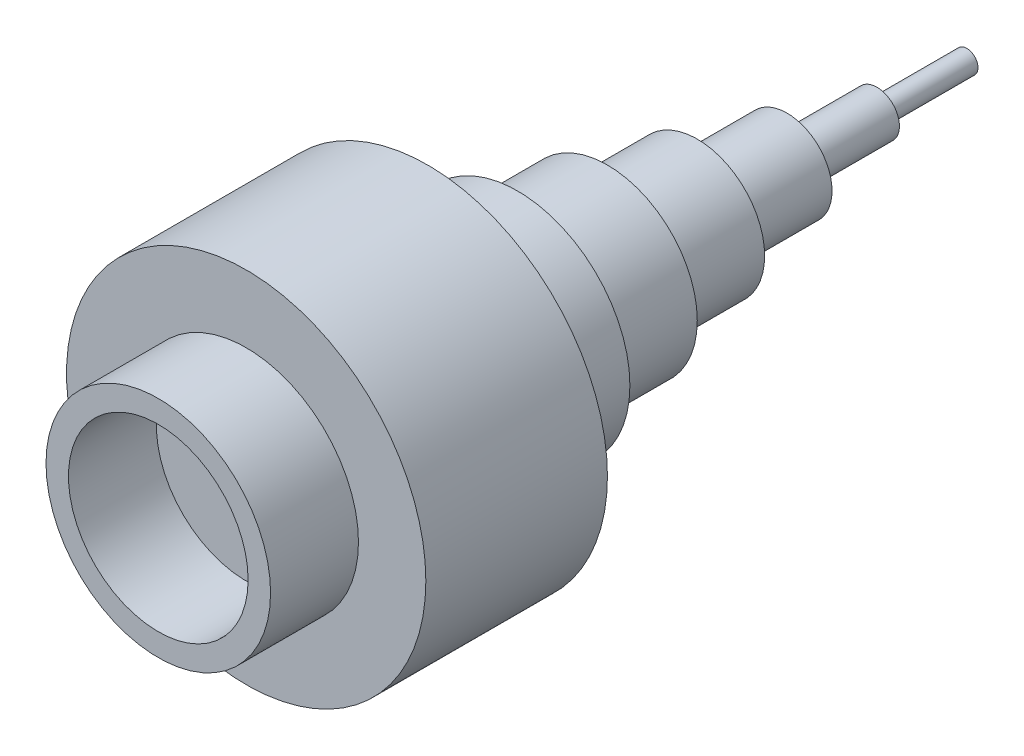
ISO-10303-21;
HEADER;
FILE_DESCRIPTION(('STEP AP214'),'2;1');
FILE_NAME('part.step','',(''),(''),'','','');
FILE_SCHEMA(('AUTOMOTIVE_DESIGN { 1 0 10303 214 1 1 1 1 }'));
ENDSEC;
DATA;
#1=APPLICATION_CONTEXT('core data for automotive mechanical design processes');
#2=APPLICATION_PROTOCOL_DEFINITION('international standard','automotive_design',2000,#1);
#3=PRODUCT_CONTEXT('',#1,'mechanical');
#4=PRODUCT('Part','Part','',(#3));
#5=PRODUCT_RELATED_PRODUCT_CATEGORY('part','',(#4));
#6=PRODUCT_DEFINITION_FORMATION('','',#4);
#7=PRODUCT_DEFINITION_CONTEXT('part definition',#1,'design');
#8=PRODUCT_DEFINITION('design','',#6,#7);
#9=PRODUCT_DEFINITION_SHAPE('','',#8);
#10=(LENGTH_UNIT() NAMED_UNIT(*) SI_UNIT(.MILLI.,.METRE.));
#11=(NAMED_UNIT(*) PLANE_ANGLE_UNIT() SI_UNIT($,.RADIAN.));
#12=(NAMED_UNIT(*) SI_UNIT($,.STERADIAN.) SOLID_ANGLE_UNIT());
#13=UNCERTAINTY_MEASURE_WITH_UNIT(LENGTH_MEASURE(1.E-05),#10,'distance_accuracy_value','');
#14=(GEOMETRIC_REPRESENTATION_CONTEXT(3) GLOBAL_UNCERTAINTY_ASSIGNED_CONTEXT((#13)) GLOBAL_UNIT_ASSIGNED_CONTEXT((#10,
#11,#12)) REPRESENTATION_CONTEXT('',''));
#15=CARTESIAN_POINT('',(0.,0.,0.));
#16=DIRECTION('',(0.,0.,1.));
#17=DIRECTION('',(1.,0.,0.));
#18=AXIS2_PLACEMENT_3D('',#15,#16,#17);
#19=CARTESIAN_POINT('',(0.,0.,-180.));
#20=DIRECTION('',(0.,0.,-1.));
#21=DIRECTION('',(-1.,0.,0.));
#22=AXIS2_PLACEMENT_3D('',#19,#20,#21);
#23=PLANE('',#22);
#24=CARTESIAN_POINT('',(0.,0.,-180.));
#25=DIRECTION('',(0.,0.,1.));
#26=DIRECTION('',(1.,0.,0.));
#27=AXIS2_PLACEMENT_3D('',#24,#25,#26);
#28=CIRCLE('',#27,2.5);
#29=CARTESIAN_POINT('',(2.5,0.,-180.));
#30=VERTEX_POINT('',#29);
#31=EDGE_CURVE('E10',#30,#30,#28,.T.);
#32=ORIENTED_EDGE('',*,*,#31,.F.);
#33=EDGE_LOOP('',(#32));
#34=FACE_BOUND('',#33,.T.);
#35=ADVANCED_FACE('F31',(#34),#23,.T.);
#36=CARTESIAN_POINT('',(0.,0.,0.));
#37=DIRECTION('',(0.,0.,1.));
#38=DIRECTION('',(1.,0.,0.));
#39=AXIS2_PLACEMENT_3D('',#36,#37,#38);
#40=CYLINDRICAL_SURFACE('',#39,2.5);
#41=ORIENTED_EDGE('',*,*,#31,.T.);
#42=EDGE_LOOP('',(#41));
#43=FACE_BOUND('',#42,.T.);
#44=CARTESIAN_POINT('',(0.,0.,-160.));
#45=DIRECTION('',(0.,0.,1.));
#46=DIRECTION('',(1.,0.,0.));
#47=AXIS2_PLACEMENT_3D('',#44,#45,#46);
#48=CIRCLE('',#47,2.5);
#49=CARTESIAN_POINT('',(2.5,0.,-160.));
#50=VERTEX_POINT('',#49);
#51=EDGE_CURVE('E37',#50,#50,#48,.T.);
#52=ORIENTED_EDGE('',*,*,#51,.F.);
#53=EDGE_LOOP('',(#52));
#54=FACE_BOUND('',#53,.T.);
#55=ADVANCED_FACE('F109',(#43,#54),#40,.T.);
#56=CARTESIAN_POINT('',(2.5,0.,-160.));
#57=DIRECTION('',(0.,0.,-1.));
#58=DIRECTION('',(-1.,0.,0.));
#59=AXIS2_PLACEMENT_3D('',#56,#57,#58);
#60=PLANE('',#59);
#61=ORIENTED_EDGE('',*,*,#51,.T.);
#62=EDGE_LOOP('',(#61));
#63=FACE_BOUND('',#62,.T.);
#64=CARTESIAN_POINT('',(0.,0.,-160.));
#65=DIRECTION('',(0.,0.,1.));
#66=DIRECTION('',(1.,0.,0.));
#67=AXIS2_PLACEMENT_3D('',#64,#65,#66);
#68=CIRCLE('',#67,5.);
#69=CARTESIAN_POINT('',(5.,0.,-160.));
#70=VERTEX_POINT('',#69);
#71=EDGE_CURVE('E41',#70,#70,#68,.T.);
#72=ORIENTED_EDGE('',*,*,#71,.F.);
#73=EDGE_LOOP('',(#72));
#74=FACE_BOUND('',#73,.T.);
#75=ADVANCED_FACE('F114',(#63,#74),#60,.T.);
#76=CARTESIAN_POINT('',(0.,0.,0.));
#77=DIRECTION('',(0.,0.,1.));
#78=DIRECTION('',(1.,0.,0.));
#79=AXIS2_PLACEMENT_3D('',#76,#77,#78);
#80=CYLINDRICAL_SURFACE('',#79,5.);
#81=ORIENTED_EDGE('',*,*,#71,.T.);
#82=EDGE_LOOP('',(#81));
#83=FACE_BOUND('',#82,.T.);
#84=CARTESIAN_POINT('',(0.,0.,-140.));
#85=DIRECTION('',(0.,0.,1.));
#86=DIRECTION('',(1.,0.,0.));
#87=AXIS2_PLACEMENT_3D('',#84,#85,#86);
#88=CIRCLE('',#87,5.);
#89=CARTESIAN_POINT('',(5.,0.,-140.));
#90=VERTEX_POINT('',#89);
#91=EDGE_CURVE('E45',#90,#90,#88,.T.);
#92=ORIENTED_EDGE('',*,*,#91,.F.);
#93=EDGE_LOOP('',(#92));
#94=FACE_BOUND('',#93,.T.);
#95=ADVANCED_FACE('F118',(#83,#94),#80,.T.);
#96=CARTESIAN_POINT('',(5.,0.,-140.));
#97=DIRECTION('',(0.,0.,-1.));
#98=DIRECTION('',(-1.,0.,0.));
#99=AXIS2_PLACEMENT_3D('',#96,#97,#98);
#100=PLANE('',#99);
#101=ORIENTED_EDGE('',*,*,#91,.T.);
#102=EDGE_LOOP('',(#101));
#103=FACE_BOUND('',#102,.T.);
#104=CARTESIAN_POINT('',(0.,0.,-140.));
#105=DIRECTION('',(0.,0.,1.));
#106=DIRECTION('',(1.,0.,0.));
#107=AXIS2_PLACEMENT_3D('',#104,#105,#106);
#108=CIRCLE('',#107,10.);
#109=CARTESIAN_POINT('',(10.,0.,-140.));
#110=VERTEX_POINT('',#109);
#111=EDGE_CURVE('E50',#110,#110,#108,.T.);
#112=ORIENTED_EDGE('',*,*,#111,.F.);
#113=EDGE_LOOP('',(#112));
#114=FACE_BOUND('',#113,.T.);
#115=ADVANCED_FACE('F124',(#103,#114),#100,.T.);
#116=CARTESIAN_POINT('',(0.,0.,0.));
#117=DIRECTION('',(0.,0.,1.));
#118=DIRECTION('',(1.,0.,0.));
#119=AXIS2_PLACEMENT_3D('',#116,#117,#118);
#120=CYLINDRICAL_SURFACE('',#119,10.);
#121=ORIENTED_EDGE('',*,*,#111,.T.);
#122=EDGE_LOOP('',(#121));
#123=FACE_BOUND('',#122,.T.);
#124=CARTESIAN_POINT('',(0.,0.,-120.));
#125=DIRECTION('',(0.,0.,1.));
#126=DIRECTION('',(1.,0.,0.));
#127=AXIS2_PLACEMENT_3D('',#124,#125,#126);
#128=CIRCLE('',#127,10.);
#129=CARTESIAN_POINT('',(10.,0.,-120.));
#130=VERTEX_POINT('',#129);
#131=EDGE_CURVE('E53',#130,#130,#128,.T.);
#132=ORIENTED_EDGE('',*,*,#131,.F.);
#133=EDGE_LOOP('',(#132));
#134=FACE_BOUND('',#133,.T.);
#135=ADVANCED_FACE('F128',(#123,#134),#120,.T.);
#136=CARTESIAN_POINT('',(10.,0.,-120.));
#137=DIRECTION('',(0.,0.,-1.));
#138=DIRECTION('',(-1.,0.,0.));
#139=AXIS2_PLACEMENT_3D('',#136,#137,#138);
#140=PLANE('',#139);
#141=ORIENTED_EDGE('',*,*,#131,.T.);
#142=EDGE_LOOP('',(#141));
#143=FACE_BOUND('',#142,.T.);
#144=CARTESIAN_POINT('',(0.,0.,-120.));
#145=DIRECTION('',(0.,0.,1.));
#146=DIRECTION('',(1.,0.,0.));
#147=AXIS2_PLACEMENT_3D('',#144,#145,#146);
#148=CIRCLE('',#147,15.);
#149=CARTESIAN_POINT('',(15.,0.,-120.));
#150=VERTEX_POINT('',#149);
#151=EDGE_CURVE('E56',#150,#150,#148,.T.);
#152=ORIENTED_EDGE('',*,*,#151,.F.);
#153=EDGE_LOOP('',(#152));
#154=FACE_BOUND('',#153,.T.);
#155=ADVANCED_FACE('F132',(#143,#154),#140,.T.);
#156=CARTESIAN_POINT('',(0.,0.,0.));
#157=DIRECTION('',(0.,0.,1.));
#158=DIRECTION('',(1.,0.,0.));
#159=AXIS2_PLACEMENT_3D('',#156,#157,#158);
#160=CYLINDRICAL_SURFACE('',#159,15.);
#161=ORIENTED_EDGE('',*,*,#151,.T.);
#162=EDGE_LOOP('',(#161));
#163=FACE_BOUND('',#162,.T.);
#164=CARTESIAN_POINT('',(0.,0.,-100.));
#165=DIRECTION('',(0.,0.,1.));
#166=DIRECTION('',(1.,0.,0.));
#167=AXIS2_PLACEMENT_3D('',#164,#165,#166);
#168=CIRCLE('',#167,15.);
#169=CARTESIAN_POINT('',(15.,0.,-100.));
#170=VERTEX_POINT('',#169);
#171=EDGE_CURVE('E59',#170,#170,#168,.T.);
#172=ORIENTED_EDGE('',*,*,#171,.F.);
#173=EDGE_LOOP('',(#172));
#174=FACE_BOUND('',#173,.T.);
#175=ADVANCED_FACE('F136',(#163,#174),#160,.T.);
#176=CARTESIAN_POINT('',(15.,0.,-100.));
#177=DIRECTION('',(0.,0.,-1.));
#178=DIRECTION('',(-1.,0.,0.));
#179=AXIS2_PLACEMENT_3D('',#176,#177,#178);
#180=PLANE('',#179);
#181=ORIENTED_EDGE('',*,*,#171,.T.);
#182=EDGE_LOOP('',(#181));
#183=FACE_BOUND('',#182,.T.);
#184=CARTESIAN_POINT('',(0.,0.,-100.));
#185=DIRECTION('',(0.,0.,1.));
#186=DIRECTION('',(1.,0.,0.));
#187=AXIS2_PLACEMENT_3D('',#184,#185,#186);
#188=CIRCLE('',#187,20.);
#189=CARTESIAN_POINT('',(20.,0.,-100.));
#190=VERTEX_POINT('',#189);
#191=EDGE_CURVE('E62',#190,#190,#188,.T.);
#192=ORIENTED_EDGE('',*,*,#191,.F.);
#193=EDGE_LOOP('',(#192));
#194=FACE_BOUND('',#193,.T.);
#195=ADVANCED_FACE('F140',(#183,#194),#180,.T.);
#196=CARTESIAN_POINT('',(0.,0.,0.));
#197=DIRECTION('',(0.,0.,1.));
#198=DIRECTION('',(1.,0.,0.));
#199=AXIS2_PLACEMENT_3D('',#196,#197,#198);
#200=CYLINDRICAL_SURFACE('',#199,20.);
#201=ORIENTED_EDGE('',*,*,#191,.T.);
#202=EDGE_LOOP('',(#201));
#203=FACE_BOUND('',#202,.T.);
#204=CARTESIAN_POINT('',(0.,0.,-80.));
#205=DIRECTION('',(0.,0.,1.));
#206=DIRECTION('',(1.,0.,0.));
#207=AXIS2_PLACEMENT_3D('',#204,#205,#206);
#208=CIRCLE('',#207,20.);
#209=CARTESIAN_POINT('',(20.,0.,-80.));
#210=VERTEX_POINT('',#209);
#211=EDGE_CURVE('E65',#210,#210,#208,.T.);
#212=ORIENTED_EDGE('',*,*,#211,.F.);
#213=EDGE_LOOP('',(#212));
#214=FACE_BOUND('',#213,.T.);
#215=ADVANCED_FACE('F144',(#203,#214),#200,.T.);
#216=CARTESIAN_POINT('',(20.,0.,-80.));
#217=DIRECTION('',(0.,0.,-1.));
#218=DIRECTION('',(-1.,0.,0.));
#219=AXIS2_PLACEMENT_3D('',#216,#217,#218);
#220=PLANE('',#219);
#221=ORIENTED_EDGE('',*,*,#211,.T.);
#222=EDGE_LOOP('',(#221));
#223=FACE_BOUND('',#222,.T.);
#224=CARTESIAN_POINT('',(0.,0.,-80.));
#225=DIRECTION('',(0.,0.,1.));
#226=DIRECTION('',(1.,0.,0.));
#227=AXIS2_PLACEMENT_3D('',#224,#225,#226);
#228=CIRCLE('',#227,25.);
#229=CARTESIAN_POINT('',(25.,0.,-80.));
#230=VERTEX_POINT('',#229);
#231=EDGE_CURVE('E68',#230,#230,#228,.T.);
#232=ORIENTED_EDGE('',*,*,#231,.F.);
#233=EDGE_LOOP('',(#232));
#234=FACE_BOUND('',#233,.T.);
#235=ADVANCED_FACE('F148',(#223,#234),#220,.T.);
#236=CARTESIAN_POINT('',(0.,0.,0.));
#237=DIRECTION('',(0.,0.,1.));
#238=DIRECTION('',(1.,0.,0.));
#239=AXIS2_PLACEMENT_3D('',#236,#237,#238);
#240=CYLINDRICAL_SURFACE('',#239,25.);
#241=ORIENTED_EDGE('',*,*,#231,.T.);
#242=EDGE_LOOP('',(#241));
#243=FACE_BOUND('',#242,.T.);
#244=CARTESIAN_POINT('',(0.,0.,-60.));
#245=DIRECTION('',(0.,0.,1.));
#246=DIRECTION('',(1.,0.,0.));
#247=AXIS2_PLACEMENT_3D('',#244,#245,#246);
#248=CIRCLE('',#247,25.);
#249=CARTESIAN_POINT('',(25.,0.,-60.));
#250=VERTEX_POINT('',#249);
#251=EDGE_CURVE('E71',#250,#250,#248,.T.);
#252=ORIENTED_EDGE('',*,*,#251,.F.);
#253=EDGE_LOOP('',(#252));
#254=FACE_BOUND('',#253,.T.);
#255=ADVANCED_FACE('F152',(#243,#254),#240,.T.);
#256=CARTESIAN_POINT('',(25.,0.,-60.));
#257=DIRECTION('',(0.,0.,-1.));
#258=DIRECTION('',(-1.,0.,0.));
#259=AXIS2_PLACEMENT_3D('',#256,#257,#258);
#260=PLANE('',#259);
#261=ORIENTED_EDGE('',*,*,#251,.T.);
#262=EDGE_LOOP('',(#261));
#263=FACE_BOUND('',#262,.T.);
#264=CARTESIAN_POINT('',(0.,0.,-60.));
#265=DIRECTION('',(0.,0.,1.));
#266=DIRECTION('',(1.,0.,0.));
#267=AXIS2_PLACEMENT_3D('',#264,#265,#266);
#268=CIRCLE('',#267,40.);
#269=CARTESIAN_POINT('',(40.,0.,-60.));
#270=VERTEX_POINT('',#269);
#271=EDGE_CURVE('E74',#270,#270,#268,.T.);
#272=ORIENTED_EDGE('',*,*,#271,.F.);
#273=EDGE_LOOP('',(#272));
#274=FACE_BOUND('',#273,.T.);
#275=ADVANCED_FACE('F156',(#263,#274),#260,.T.);
#276=CARTESIAN_POINT('',(0.,0.,0.));
#277=DIRECTION('',(0.,0.,1.));
#278=DIRECTION('',(1.,0.,0.));
#279=AXIS2_PLACEMENT_3D('',#276,#277,#278);
#280=CYLINDRICAL_SURFACE('',#279,40.);
#281=ORIENTED_EDGE('',*,*,#271,.T.);
#282=EDGE_LOOP('',(#281));
#283=FACE_BOUND('',#282,.T.);
#284=CARTESIAN_POINT('',(0.,0.,-19.5698951759648));
#285=DIRECTION('',(0.,0.,1.));
#286=DIRECTION('',(1.,0.,0.));
#287=AXIS2_PLACEMENT_3D('',#284,#285,#286);
#288=CIRCLE('',#287,40.);
#289=CARTESIAN_POINT('',(40.,0.,-19.5698951759648));
#290=VERTEX_POINT('',#289);
#291=EDGE_CURVE('E77',#290,#290,#288,.T.);
#292=ORIENTED_EDGE('',*,*,#291,.F.);
#293=EDGE_LOOP('',(#292));
#294=FACE_BOUND('',#293,.T.);
#295=ADVANCED_FACE('F160',(#283,#294),#280,.T.);
#296=CARTESIAN_POINT('',(40.,0.,-19.5698951759648));
#297=DIRECTION('',(0.,0.,1.));
#298=DIRECTION('',(1.,0.,0.));
#299=AXIS2_PLACEMENT_3D('',#296,#297,#298);
#300=PLANE('',#299);
#301=ORIENTED_EDGE('',*,*,#291,.T.);
#302=EDGE_LOOP('',(#301));
#303=FACE_BOUND('',#302,.T.);
#304=CARTESIAN_POINT('',(0.,0.,-19.5698951759648));
#305=DIRECTION('',(0.,0.,1.));
#306=DIRECTION('',(1.,0.,0.));
#307=AXIS2_PLACEMENT_3D('',#304,#305,#306);
#308=CIRCLE('',#307,25.);
#309=CARTESIAN_POINT('',(25.,0.,-19.5698951759648));
#310=VERTEX_POINT('',#309);
#311=EDGE_CURVE('E80',#310,#310,#308,.T.);
#312=ORIENTED_EDGE('',*,*,#311,.F.);
#313=EDGE_LOOP('',(#312));
#314=FACE_BOUND('',#313,.T.);
#315=ADVANCED_FACE('F164',(#303,#314),#300,.T.);
#316=CARTESIAN_POINT('',(0.,0.,0.));
#317=DIRECTION('',(0.,0.,1.));
#318=DIRECTION('',(1.,0.,0.));
#319=AXIS2_PLACEMENT_3D('',#316,#317,#318);
#320=CYLINDRICAL_SURFACE('',#319,25.);
#321=ORIENTED_EDGE('',*,*,#311,.T.);
#322=EDGE_LOOP('',(#321));
#323=FACE_BOUND('',#322,.T.);
#324=CARTESIAN_POINT('',(0.,0.,0.));
#325=DIRECTION('',(0.,0.,1.));
#326=DIRECTION('',(1.,0.,0.));
#327=AXIS2_PLACEMENT_3D('',#324,#325,#326);
#328=CIRCLE('',#327,25.);
#329=CARTESIAN_POINT('',(25.,0.,0.));
#330=VERTEX_POINT('',#329);
#331=EDGE_CURVE('E83',#330,#330,#328,.T.);
#332=ORIENTED_EDGE('',*,*,#331,.F.);
#333=EDGE_LOOP('',(#332));
#334=FACE_BOUND('',#333,.T.);
#335=ADVANCED_FACE('F105',(#323,#334),#320,.T.);
#336=CARTESIAN_POINT('',(25.,0.,0.));
#337=DIRECTION('',(0.,0.,1.));
#338=DIRECTION('',(1.,0.,0.));
#339=AXIS2_PLACEMENT_3D('',#336,#337,#338);
#340=PLANE('',#339);
#341=ORIENTED_EDGE('',*,*,#331,.T.);
#342=EDGE_LOOP('',(#341));
#343=FACE_BOUND('',#342,.T.);
#344=CARTESIAN_POINT('',(0.,0.,0.));
#345=DIRECTION('',(0.,0.,1.));
#346=DIRECTION('',(1.,0.,0.));
#347=AXIS2_PLACEMENT_3D('',#344,#345,#346);
#348=CIRCLE('',#347,20.);
#349=CARTESIAN_POINT('',(20.,0.,0.));
#350=VERTEX_POINT('',#349);
#351=EDGE_CURVE('E86',#350,#350,#348,.T.);
#352=ORIENTED_EDGE('',*,*,#351,.F.);
#353=EDGE_LOOP('',(#352));
#354=FACE_BOUND('',#353,.T.);
#355=ADVANCED_FACE('F97',(#343,#354),#340,.T.);
#356=CARTESIAN_POINT('',(0.,0.,0.));
#357=DIRECTION('',(0.,0.,1.));
#358=DIRECTION('',(1.,0.,0.));
#359=AXIS2_PLACEMENT_3D('',#356,#357,#358);
#360=CYLINDRICAL_SURFACE('',#359,20.);
#361=ORIENTED_EDGE('',*,*,#351,.T.);
#362=EDGE_LOOP('',(#361));
#363=FACE_BOUND('',#362,.T.);
#364=CARTESIAN_POINT('',(0.,0.,-19.5698951759648));
#365=DIRECTION('',(0.,0.,1.));
#366=DIRECTION('',(1.,0.,0.));
#367=AXIS2_PLACEMENT_3D('',#364,#365,#366);
#368=CIRCLE('',#367,20.);
#369=CARTESIAN_POINT('',(20.,0.,-19.5698951759648));
#370=VERTEX_POINT('',#369);
#371=EDGE_CURVE('E89',#370,#370,#368,.T.);
#372=ORIENTED_EDGE('',*,*,#371,.F.);
#373=EDGE_LOOP('',(#372));
#374=FACE_BOUND('',#373,.T.);
#375=ADVANCED_FACE('F95',(#363,#374),#360,.F.);
#376=CARTESIAN_POINT('',(20.,0.,-19.5698951759648));
#377=DIRECTION('',(0.,0.,1.));
#378=DIRECTION('',(1.,0.,0.));
#379=AXIS2_PLACEMENT_3D('',#376,#377,#378);
#380=PLANE('',#379);
#381=ORIENTED_EDGE('',*,*,#371,.T.);
#382=EDGE_LOOP('',(#381));
#383=FACE_BOUND('',#382,.T.);
#384=ADVANCED_FACE('F93',(#383),#380,.T.);
#385=CLOSED_SHELL('',(#35,#55,#75,#95,#115,#135,#155,#175,#195,#215,#235,#255,#275,#295,#315,
#335,#355,#375,#384));
#386=MANIFOLD_SOLID_BREP('B2',#385);
#387=ADVANCED_BREP_SHAPE_REPRESENTATION('',(#18,#386),#14);
#388=SHAPE_DEFINITION_REPRESENTATION(#9,#387);
ENDSEC;
END-ISO-10303-21;
